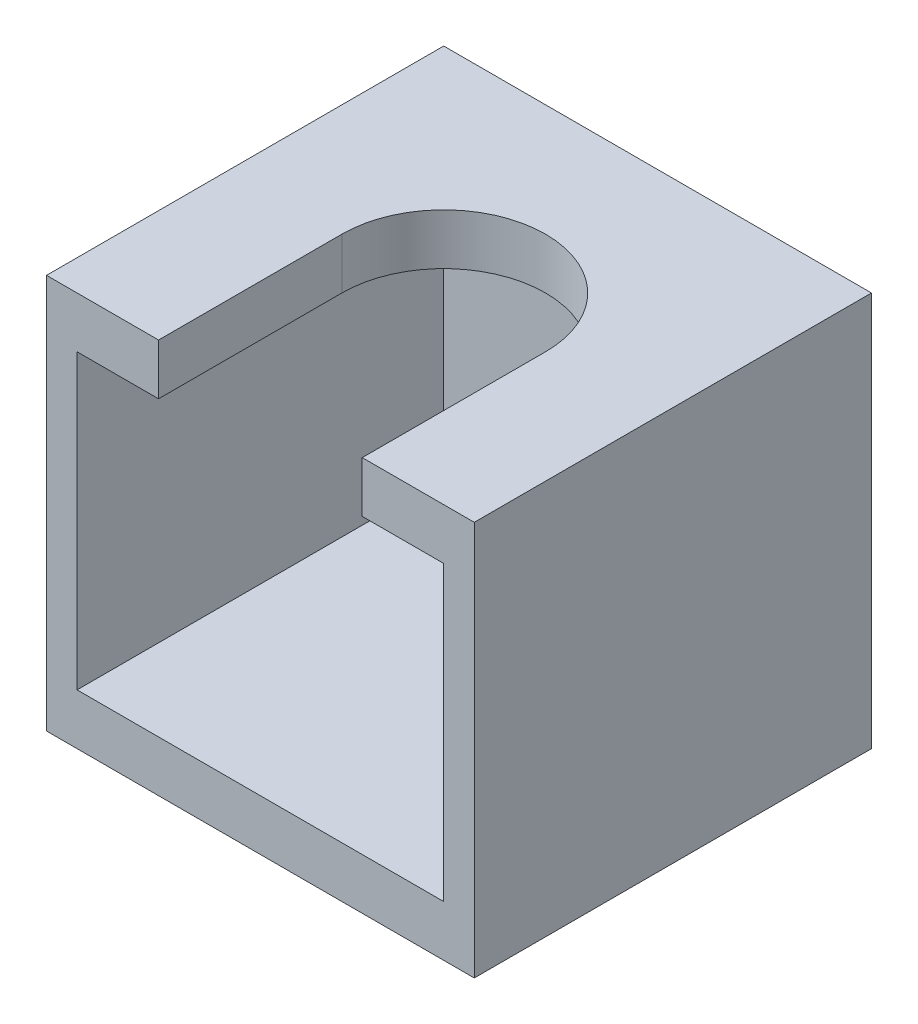
ISO-10303-21;
HEADER;
FILE_DESCRIPTION(('STEP AP214'),'2;1');
FILE_NAME('part.step','',(''),(''),'','','');
FILE_SCHEMA(('AUTOMOTIVE_DESIGN { 1 0 10303 214 1 1 1 1 }'));
ENDSEC;
DATA;
#1=APPLICATION_CONTEXT('core data for automotive mechanical design processes');
#2=APPLICATION_PROTOCOL_DEFINITION('international standard','automotive_design',2000,#1);
#3=PRODUCT_CONTEXT('',#1,'mechanical');
#4=PRODUCT('Part','Part','',(#3));
#5=PRODUCT_RELATED_PRODUCT_CATEGORY('part','',(#4));
#6=PRODUCT_DEFINITION_FORMATION('','',#4);
#7=PRODUCT_DEFINITION_CONTEXT('part definition',#1,'design');
#8=PRODUCT_DEFINITION('design','',#6,#7);
#9=PRODUCT_DEFINITION_SHAPE('','',#8);
#10=(LENGTH_UNIT() NAMED_UNIT(*) SI_UNIT(.MILLI.,.METRE.));
#11=(NAMED_UNIT(*) PLANE_ANGLE_UNIT() SI_UNIT($,.RADIAN.));
#12=(NAMED_UNIT(*) SI_UNIT($,.STERADIAN.) SOLID_ANGLE_UNIT());
#13=UNCERTAINTY_MEASURE_WITH_UNIT(LENGTH_MEASURE(1.E-05),#10,'distance_accuracy_value','');
#14=(GEOMETRIC_REPRESENTATION_CONTEXT(3) GLOBAL_UNCERTAINTY_ASSIGNED_CONTEXT((#13)) GLOBAL_UNIT_ASSIGNED_CONTEXT((#10,
#11,#12)) REPRESENTATION_CONTEXT('',''));
#15=CARTESIAN_POINT('',(0.,0.,0.));
#16=DIRECTION('',(0.,0.,1.));
#17=DIRECTION('',(1.,0.,0.));
#18=AXIS2_PLACEMENT_3D('',#15,#16,#17);
#19=CARTESIAN_POINT('',(8.4,11.5,-8.4));
#20=DIRECTION('',(-1.,0.,0.));
#21=DIRECTION('',(0.,0.,1.));
#22=AXIS2_PLACEMENT_3D('',#19,#20,#21);
#23=PLANE('',#22);
#24=DIRECTION('',(0.,-1.,0.));
#25=VECTOR('',#24,1.);
#26=CARTESIAN_POINT('',(8.4,11.5,7.2));
#27=LINE('',#26,#25);
#28=CARTESIAN_POINT('',(8.4,13.5,7.2));
#29=VERTEX_POINT('',#28);
#30=CARTESIAN_POINT('',(8.4,-2.,7.2));
#31=VERTEX_POINT('',#30);
#32=EDGE_CURVE('E11',#29,#31,#27,.T.);
#33=ORIENTED_EDGE('',*,*,#32,.T.);
#34=DIRECTION('',(0.,0.,1.));
#35=VECTOR('',#34,1.);
#36=CARTESIAN_POINT('',(8.4,-2.,7.2));
#37=LINE('',#36,#35);
#38=CARTESIAN_POINT('',(8.4,-2.,-8.4));
#39=VERTEX_POINT('',#38);
#40=EDGE_CURVE('E186',#39,#31,#37,.T.);
#41=ORIENTED_EDGE('',*,*,#40,.F.);
#42=DIRECTION('',(0.,-1.,0.));
#43=VECTOR('',#42,1.);
#44=CARTESIAN_POINT('',(8.4,11.5,-8.4));
#45=LINE('',#44,#43);
#46=CARTESIAN_POINT('',(8.4,13.5,-8.4));
#47=VERTEX_POINT('',#46);
#48=EDGE_CURVE('E44',#47,#39,#45,.T.);
#49=ORIENTED_EDGE('',*,*,#48,.F.);
#50=DIRECTION('',(0.,0.,-1.));
#51=VECTOR('',#50,1.);
#52=CARTESIAN_POINT('',(8.4,13.5,-8.4));
#53=LINE('',#52,#51);
#54=EDGE_CURVE('E161',#29,#47,#53,.T.);
#55=ORIENTED_EDGE('',*,*,#54,.F.);
#56=EDGE_LOOP('',(#33,#41,#49,#55));
#57=FACE_BOUND('',#56,.T.);
#58=ADVANCED_FACE('F36',(#57),#23,.F.);
#59=CARTESIAN_POINT('',(-8.4,11.5,-8.4));
#60=DIRECTION('',(0.,0.,1.));
#61=DIRECTION('',(1.,0.,0.));
#62=AXIS2_PLACEMENT_3D('',#59,#60,#61);
#63=PLANE('',#62);
#64=ORIENTED_EDGE('',*,*,#48,.T.);
#65=DIRECTION('',(1.,0.,0.));
#66=VECTOR('',#65,1.);
#67=CARTESIAN_POINT('',(-8.4,-2.,-8.4));
#68=LINE('',#67,#66);
#69=CARTESIAN_POINT('',(-8.4,-2.,-8.4));
#70=VERTEX_POINT('',#69);
#71=EDGE_CURVE('E183',#70,#39,#68,.T.);
#72=ORIENTED_EDGE('',*,*,#71,.F.);
#73=DIRECTION('',(0.,-1.,0.));
#74=VECTOR('',#73,1.);
#75=CARTESIAN_POINT('',(-8.4,11.5,-8.4));
#76=LINE('',#75,#74);
#77=CARTESIAN_POINT('',(-8.4,13.5,-8.4));
#78=VERTEX_POINT('',#77);
#79=EDGE_CURVE('E130',#78,#70,#76,.T.);
#80=ORIENTED_EDGE('',*,*,#79,.F.);
#81=DIRECTION('',(-1.,0.,0.));
#82=VECTOR('',#81,1.);
#83=CARTESIAN_POINT('',(-8.4,13.5,-8.4));
#84=LINE('',#83,#82);
#85=EDGE_CURVE('E146',#47,#78,#84,.T.);
#86=ORIENTED_EDGE('',*,*,#85,.F.);
#87=EDGE_LOOP('',(#64,#72,#80,#86));
#88=FACE_BOUND('',#87,.T.);
#89=ADVANCED_FACE('F221',(#88),#63,.F.);
#90=CARTESIAN_POINT('',(-8.4,11.5,-8.4));
#91=DIRECTION('',(1.,0.,0.));
#92=DIRECTION('',(0.,0.,-1.));
#93=AXIS2_PLACEMENT_3D('',#90,#91,#92);
#94=PLANE('',#93);
#95=ORIENTED_EDGE('',*,*,#79,.T.);
#96=DIRECTION('',(0.,0.,-1.));
#97=VECTOR('',#96,1.);
#98=CARTESIAN_POINT('',(-8.4,-2.,7.2));
#99=LINE('',#98,#97);
#100=CARTESIAN_POINT('',(-8.4,-2.,7.2));
#101=VERTEX_POINT('',#100);
#102=EDGE_CURVE('E126',#101,#70,#99,.T.);
#103=ORIENTED_EDGE('',*,*,#102,.F.);
#104=DIRECTION('',(0.,-1.,0.));
#105=VECTOR('',#104,1.);
#106=CARTESIAN_POINT('',(-8.4,11.5,7.2));
#107=LINE('',#106,#105);
#108=CARTESIAN_POINT('',(-8.4,13.5,7.2));
#109=VERTEX_POINT('',#108);
#110=EDGE_CURVE('E120',#109,#101,#107,.T.);
#111=ORIENTED_EDGE('',*,*,#110,.F.);
#112=DIRECTION('',(0.,0.,1.));
#113=VECTOR('',#112,1.);
#114=CARTESIAN_POINT('',(-8.4,13.5,-8.4));
#115=LINE('',#114,#113);
#116=EDGE_CURVE('E124',#78,#109,#115,.T.);
#117=ORIENTED_EDGE('',*,*,#116,.F.);
#118=EDGE_LOOP('',(#95,#103,#111,#117));
#119=FACE_BOUND('',#118,.T.);
#120=ADVANCED_FACE('F122',(#119),#94,.F.);
#121=CARTESIAN_POINT('',(-7.2,11.5,7.2));
#122=DIRECTION('',(0.,0.,-1.));
#123=DIRECTION('',(-1.,0.,0.));
#124=AXIS2_PLACEMENT_3D('',#121,#122,#123);
#125=PLANE('',#124);
#126=ORIENTED_EDGE('',*,*,#110,.T.);
#127=DIRECTION('',(-1.,0.,0.));
#128=VECTOR('',#127,1.);
#129=CARTESIAN_POINT('',(-8.4,-2.,7.2));
#130=LINE('',#129,#128);
#131=EDGE_CURVE('E189',#31,#101,#130,.T.);
#132=ORIENTED_EDGE('',*,*,#131,.F.);
#133=ORIENTED_EDGE('',*,*,#32,.F.);
#134=DIRECTION('',(1.,0.,0.));
#135=VECTOR('',#134,1.);
#136=CARTESIAN_POINT('',(4.,13.5,7.2));
#137=LINE('',#136,#135);
#138=CARTESIAN_POINT('',(4.,13.5,7.2));
#139=VERTEX_POINT('',#138);
#140=EDGE_CURVE('E158',#139,#29,#137,.T.);
#141=ORIENTED_EDGE('',*,*,#140,.F.);
#142=DIRECTION('',(0.,-1.,0.));
#143=VECTOR('',#142,1.);
#144=CARTESIAN_POINT('',(4.,13.5,7.2));
#145=LINE('',#144,#143);
#146=CARTESIAN_POINT('',(4.,11.5,7.2));
#147=VERTEX_POINT('',#146);
#148=EDGE_CURVE('E164',#139,#147,#145,.T.);
#149=ORIENTED_EDGE('',*,*,#148,.T.);
#150=DIRECTION('',(1.,0.,0.));
#151=VECTOR('',#150,1.);
#152=CARTESIAN_POINT('',(4.,11.5,7.2));
#153=LINE('',#152,#151);
#154=CARTESIAN_POINT('',(7.2,11.5,7.2));
#155=VERTEX_POINT('',#154);
#156=EDGE_CURVE('E147',#147,#155,#153,.T.);
#157=ORIENTED_EDGE('',*,*,#156,.T.);
#158=DIRECTION('',(0.,-1.,0.));
#159=VECTOR('',#158,1.);
#160=CARTESIAN_POINT('',(7.2,11.5,7.2));
#161=LINE('',#160,#159);
#162=CARTESIAN_POINT('',(7.2,0.,7.2));
#163=VERTEX_POINT('',#162);
#164=EDGE_CURVE('E204',#155,#163,#161,.T.);
#165=ORIENTED_EDGE('',*,*,#164,.T.);
#166=DIRECTION('',(-1.,0.,0.));
#167=VECTOR('',#166,1.);
#168=CARTESIAN_POINT('',(-8.4,0.,7.2));
#169=LINE('',#168,#167);
#170=CARTESIAN_POINT('',(-7.2,0.,7.2));
#171=VERTEX_POINT('',#170);
#172=EDGE_CURVE('E181',#163,#171,#169,.T.);
#173=ORIENTED_EDGE('',*,*,#172,.T.);
#174=DIRECTION('',(0.,-1.,0.));
#175=VECTOR('',#174,1.);
#176=CARTESIAN_POINT('',(-7.2,11.5,7.2));
#177=LINE('',#176,#175);
#178=CARTESIAN_POINT('',(-7.2,11.5,7.2));
#179=VERTEX_POINT('',#178);
#180=EDGE_CURVE('E131',#179,#171,#177,.T.);
#181=ORIENTED_EDGE('',*,*,#180,.F.);
#182=DIRECTION('',(1.,0.,0.));
#183=VECTOR('',#182,1.);
#184=CARTESIAN_POINT('',(-8.4,11.5,7.2));
#185=LINE('',#184,#183);
#186=CARTESIAN_POINT('',(-4.,11.5,7.2));
#187=VERTEX_POINT('',#186);
#188=EDGE_CURVE('E165',#179,#187,#185,.T.);
#189=ORIENTED_EDGE('',*,*,#188,.T.);
#190=DIRECTION('',(0.,-1.,0.));
#191=VECTOR('',#190,1.);
#192=CARTESIAN_POINT('',(-4.,13.5,7.2));
#193=LINE('',#192,#191);
#194=CARTESIAN_POINT('',(-4.,13.5,7.2));
#195=VERTEX_POINT('',#194);
#196=EDGE_CURVE('E137',#195,#187,#193,.T.);
#197=ORIENTED_EDGE('',*,*,#196,.F.);
#198=DIRECTION('',(1.,0.,0.));
#199=VECTOR('',#198,1.);
#200=CARTESIAN_POINT('',(-8.4,13.5,7.2));
#201=LINE('',#200,#199);
#202=EDGE_CURVE('E134',#109,#195,#201,.T.);
#203=ORIENTED_EDGE('',*,*,#202,.F.);
#204=EDGE_LOOP('',(#126,#132,#133,#141,#149,#157,#165,#173,#181,#189,#197,#203));
#205=FACE_BOUND('',#204,.T.);
#206=ADVANCED_FACE('F135',(#205),#125,.F.);
#207=CARTESIAN_POINT('',(-7.2,11.5,-7.2));
#208=DIRECTION('',(-1.,0.,0.));
#209=DIRECTION('',(0.,0.,1.));
#210=AXIS2_PLACEMENT_3D('',#207,#208,#209);
#211=PLANE('',#210);
#212=DIRECTION('',(0.,0.,-1.));
#213=VECTOR('',#212,1.);
#214=CARTESIAN_POINT('',(-7.2,0.,-7.2));
#215=LINE('',#214,#213);
#216=CARTESIAN_POINT('',(-7.2,0.,-7.2));
#217=VERTEX_POINT('',#216);
#218=EDGE_CURVE('E191',#171,#217,#215,.T.);
#219=ORIENTED_EDGE('',*,*,#218,.T.);
#220=DIRECTION('',(0.,-1.,0.));
#221=VECTOR('',#220,1.);
#222=CARTESIAN_POINT('',(-7.2,11.5,-7.2));
#223=LINE('',#222,#221);
#224=CARTESIAN_POINT('',(-7.2,11.5,-7.2));
#225=VERTEX_POINT('',#224);
#226=EDGE_CURVE('E214',#225,#217,#223,.T.);
#227=ORIENTED_EDGE('',*,*,#226,.F.);
#228=DIRECTION('',(0.,0.,-1.));
#229=VECTOR('',#228,1.);
#230=CARTESIAN_POINT('',(-7.2,11.5,-7.2));
#231=LINE('',#230,#229);
#232=EDGE_CURVE('E194',#179,#225,#231,.T.);
#233=ORIENTED_EDGE('',*,*,#232,.F.);
#234=ORIENTED_EDGE('',*,*,#180,.T.);
#235=EDGE_LOOP('',(#219,#227,#233,#234));
#236=FACE_BOUND('',#235,.T.);
#237=ADVANCED_FACE('F245',(#236),#211,.F.);
#238=CARTESIAN_POINT('',(-7.2,11.5,-7.2));
#239=DIRECTION('',(0.,0.,-1.));
#240=DIRECTION('',(-1.,0.,0.));
#241=AXIS2_PLACEMENT_3D('',#238,#239,#240);
#242=PLANE('',#241);
#243=DIRECTION('',(1.,0.,0.));
#244=VECTOR('',#243,1.);
#245=CARTESIAN_POINT('',(-7.2,0.,-7.2));
#246=LINE('',#245,#244);
#247=CARTESIAN_POINT('',(7.2,0.,-7.2));
#248=VERTEX_POINT('',#247);
#249=EDGE_CURVE('E207',#217,#248,#246,.T.);
#250=ORIENTED_EDGE('',*,*,#249,.T.);
#251=DIRECTION('',(0.,-1.,0.));
#252=VECTOR('',#251,1.);
#253=CARTESIAN_POINT('',(7.2,11.5,-7.2));
#254=LINE('',#253,#252);
#255=CARTESIAN_POINT('',(7.2,11.5,-7.2));
#256=VERTEX_POINT('',#255);
#257=EDGE_CURVE('E51',#256,#248,#254,.T.);
#258=ORIENTED_EDGE('',*,*,#257,.F.);
#259=DIRECTION('',(1.,0.,0.));
#260=VECTOR('',#259,1.);
#261=CARTESIAN_POINT('',(-7.2,11.5,-7.2));
#262=LINE('',#261,#260);
#263=EDGE_CURVE('E197',#225,#256,#262,.T.);
#264=ORIENTED_EDGE('',*,*,#263,.F.);
#265=ORIENTED_EDGE('',*,*,#226,.T.);
#266=EDGE_LOOP('',(#250,#258,#264,#265));
#267=FACE_BOUND('',#266,.T.);
#268=ADVANCED_FACE('F274',(#267),#242,.F.);
#269=CARTESIAN_POINT('',(7.2,11.5,-7.2));
#270=DIRECTION('',(1.,0.,0.));
#271=DIRECTION('',(0.,0.,-1.));
#272=AXIS2_PLACEMENT_3D('',#269,#270,#271);
#273=PLANE('',#272);
#274=DIRECTION('',(0.,0.,1.));
#275=VECTOR('',#274,1.);
#276=CARTESIAN_POINT('',(7.2,0.,-7.2));
#277=LINE('',#276,#275);
#278=EDGE_CURVE('E198',#248,#163,#277,.T.);
#279=ORIENTED_EDGE('',*,*,#278,.T.);
#280=ORIENTED_EDGE('',*,*,#164,.F.);
#281=DIRECTION('',(0.,0.,1.));
#282=VECTOR('',#281,1.);
#283=CARTESIAN_POINT('',(7.2,11.5,-7.2));
#284=LINE('',#283,#282);
#285=EDGE_CURVE('E201',#256,#155,#284,.T.);
#286=ORIENTED_EDGE('',*,*,#285,.F.);
#287=ORIENTED_EDGE('',*,*,#257,.T.);
#288=EDGE_LOOP('',(#279,#280,#286,#287));
#289=FACE_BOUND('',#288,.T.);
#290=ADVANCED_FACE('F241',(#289),#273,.F.);
#291=CARTESIAN_POINT('',(0.,-2.,0.));
#292=DIRECTION('',(0.,-1.,0.));
#293=DIRECTION('',(0.,0.,-1.));
#294=AXIS2_PLACEMENT_3D('',#291,#292,#293);
#295=PLANE('',#294);
#296=ORIENTED_EDGE('',*,*,#102,.T.);
#297=ORIENTED_EDGE('',*,*,#71,.T.);
#298=ORIENTED_EDGE('',*,*,#40,.T.);
#299=ORIENTED_EDGE('',*,*,#131,.T.);
#300=EDGE_LOOP('',(#296,#297,#298,#299));
#301=FACE_BOUND('',#300,.T.);
#302=ADVANCED_FACE('F226',(#301),#295,.T.);
#303=CARTESIAN_POINT('',(0.,0.,0.));
#304=DIRECTION('',(0.,-1.,0.));
#305=DIRECTION('',(0.,0.,-1.));
#306=AXIS2_PLACEMENT_3D('',#303,#304,#305);
#307=PLANE('',#306);
#308=ORIENTED_EDGE('',*,*,#278,.F.);
#309=ORIENTED_EDGE('',*,*,#249,.F.);
#310=ORIENTED_EDGE('',*,*,#218,.F.);
#311=ORIENTED_EDGE('',*,*,#172,.F.);
#312=EDGE_LOOP('',(#308,#309,#310,#311));
#313=FACE_BOUND('',#312,.T.);
#314=ADVANCED_FACE('F259',(#313),#307,.F.);
#315=CARTESIAN_POINT('',(-4.,13.5,0.));
#316=DIRECTION('',(-1.,0.,0.));
#317=DIRECTION('',(0.,0.,1.));
#318=AXIS2_PLACEMENT_3D('',#315,#316,#317);
#319=PLANE('',#318);
#320=DIRECTION('',(0.,0.,-1.));
#321=VECTOR('',#320,1.);
#322=CARTESIAN_POINT('',(-4.,11.5,0.));
#323=LINE('',#322,#321);
#324=CARTESIAN_POINT('',(-4.,11.5,0.));
#325=VERTEX_POINT('',#324);
#326=EDGE_CURVE('E167',#187,#325,#323,.T.);
#327=ORIENTED_EDGE('',*,*,#326,.T.);
#328=DIRECTION('',(0.,-1.,0.));
#329=VECTOR('',#328,1.);
#330=CARTESIAN_POINT('',(-4.,13.5,0.));
#331=LINE('',#330,#329);
#332=CARTESIAN_POINT('',(-4.,13.5,0.));
#333=VERTEX_POINT('',#332);
#334=EDGE_CURVE('E177',#333,#325,#331,.T.);
#335=ORIENTED_EDGE('',*,*,#334,.F.);
#336=DIRECTION('',(0.,0.,-1.));
#337=VECTOR('',#336,1.);
#338=CARTESIAN_POINT('',(-4.,13.5,0.));
#339=LINE('',#338,#337);
#340=EDGE_CURVE('E140',#195,#333,#339,.T.);
#341=ORIENTED_EDGE('',*,*,#340,.F.);
#342=ORIENTED_EDGE('',*,*,#196,.T.);
#343=EDGE_LOOP('',(#327,#335,#341,#342));
#344=FACE_BOUND('',#343,.T.);
#345=ADVANCED_FACE('F248',(#344),#319,.F.);
#346=CARTESIAN_POINT('',(0.,13.5,0.));
#347=DIRECTION('',(0.,-1.,0.));
#348=DIRECTION('',(0.,0.,-1.));
#349=AXIS2_PLACEMENT_3D('',#346,#347,#348);
#350=CYLINDRICAL_SURFACE('',#349,4.);
#351=CARTESIAN_POINT('',(0.,11.5,0.));
#352=DIRECTION('',(0.,-1.,0.));
#353=DIRECTION('',(0.,0.,-1.));
#354=AXIS2_PLACEMENT_3D('',#351,#352,#353);
#355=CIRCLE('',#354,4.);
#356=CARTESIAN_POINT('',(4.,11.5,0.));
#357=VERTEX_POINT('',#356);
#358=EDGE_CURVE('E169',#325,#357,#355,.T.);
#359=ORIENTED_EDGE('',*,*,#358,.T.);
#360=DIRECTION('',(0.,-1.,0.));
#361=VECTOR('',#360,1.);
#362=CARTESIAN_POINT('',(4.,13.5,0.));
#363=LINE('',#362,#361);
#364=CARTESIAN_POINT('',(4.,13.5,0.));
#365=VERTEX_POINT('',#364);
#366=EDGE_CURVE('E174',#365,#357,#363,.T.);
#367=ORIENTED_EDGE('',*,*,#366,.F.);
#368=CARTESIAN_POINT('',(0.,13.5,0.));
#369=DIRECTION('',(0.,-1.,0.));
#370=DIRECTION('',(0.,0.,-1.));
#371=AXIS2_PLACEMENT_3D('',#368,#369,#370);
#372=CIRCLE('',#371,4.);
#373=EDGE_CURVE('E154',#333,#365,#372,.T.);
#374=ORIENTED_EDGE('',*,*,#373,.F.);
#375=ORIENTED_EDGE('',*,*,#334,.T.);
#376=EDGE_LOOP('',(#359,#367,#374,#375));
#377=FACE_BOUND('',#376,.T.);
#378=ADVANCED_FACE('F251',(#377),#350,.F.);
#379=CARTESIAN_POINT('',(4.,13.5,0.));
#380=DIRECTION('',(1.,0.,0.));
#381=DIRECTION('',(0.,0.,-1.));
#382=AXIS2_PLACEMENT_3D('',#379,#380,#381);
#383=PLANE('',#382);
#384=DIRECTION('',(0.,0.,1.));
#385=VECTOR('',#384,1.);
#386=CARTESIAN_POINT('',(4.,11.5,0.));
#387=LINE('',#386,#385);
#388=EDGE_CURVE('E150',#357,#147,#387,.T.);
#389=ORIENTED_EDGE('',*,*,#388,.T.);
#390=ORIENTED_EDGE('',*,*,#148,.F.);
#391=DIRECTION('',(0.,0.,1.));
#392=VECTOR('',#391,1.);
#393=CARTESIAN_POINT('',(4.,13.5,0.));
#394=LINE('',#393,#392);
#395=EDGE_CURVE('E156',#365,#139,#394,.T.);
#396=ORIENTED_EDGE('',*,*,#395,.F.);
#397=ORIENTED_EDGE('',*,*,#366,.T.);
#398=EDGE_LOOP('',(#389,#390,#396,#397));
#399=FACE_BOUND('',#398,.T.);
#400=ADVANCED_FACE('F233',(#399),#383,.F.);
#401=CARTESIAN_POINT('',(0.,13.5,0.));
#402=DIRECTION('',(0.,-1.,0.));
#403=DIRECTION('',(0.,0.,-1.));
#404=AXIS2_PLACEMENT_3D('',#401,#402,#403);
#405=PLANE('',#404);
#406=ORIENTED_EDGE('',*,*,#116,.T.);
#407=ORIENTED_EDGE('',*,*,#202,.T.);
#408=ORIENTED_EDGE('',*,*,#340,.T.);
#409=ORIENTED_EDGE('',*,*,#373,.T.);
#410=ORIENTED_EDGE('',*,*,#395,.T.);
#411=ORIENTED_EDGE('',*,*,#140,.T.);
#412=ORIENTED_EDGE('',*,*,#54,.T.);
#413=ORIENTED_EDGE('',*,*,#85,.T.);
#414=EDGE_LOOP('',(#406,#407,#408,#409,#410,#411,#412,#413));
#415=FACE_BOUND('',#414,.T.);
#416=ADVANCED_FACE('F143',(#415),#405,.F.);
#417=CARTESIAN_POINT('',(0.,11.5,0.));
#418=DIRECTION('',(0.,-1.,0.));
#419=DIRECTION('',(0.,0.,-1.));
#420=AXIS2_PLACEMENT_3D('',#417,#418,#419);
#421=PLANE('',#420);
#422=ORIENTED_EDGE('',*,*,#188,.F.);
#423=ORIENTED_EDGE('',*,*,#232,.T.);
#424=ORIENTED_EDGE('',*,*,#263,.T.);
#425=ORIENTED_EDGE('',*,*,#285,.T.);
#426=ORIENTED_EDGE('',*,*,#156,.F.);
#427=ORIENTED_EDGE('',*,*,#388,.F.);
#428=ORIENTED_EDGE('',*,*,#358,.F.);
#429=ORIENTED_EDGE('',*,*,#326,.F.);
#430=EDGE_LOOP('',(#422,#423,#424,#425,#426,#427,#428,#429));
#431=FACE_BOUND('',#430,.T.);
#432=ADVANCED_FACE('F238',(#431),#421,.T.);
#433=CLOSED_SHELL('',(#58,#89,#120,#206,#237,#268,#290,#302,#314,#345,#378,#400,#416,#432));
#434=MANIFOLD_SOLID_BREP('B2',#433);
#435=ADVANCED_BREP_SHAPE_REPRESENTATION('',(#18,#434),#14);
#436=SHAPE_DEFINITION_REPRESENTATION(#9,#435);
ENDSEC;
END-ISO-10303-21;
